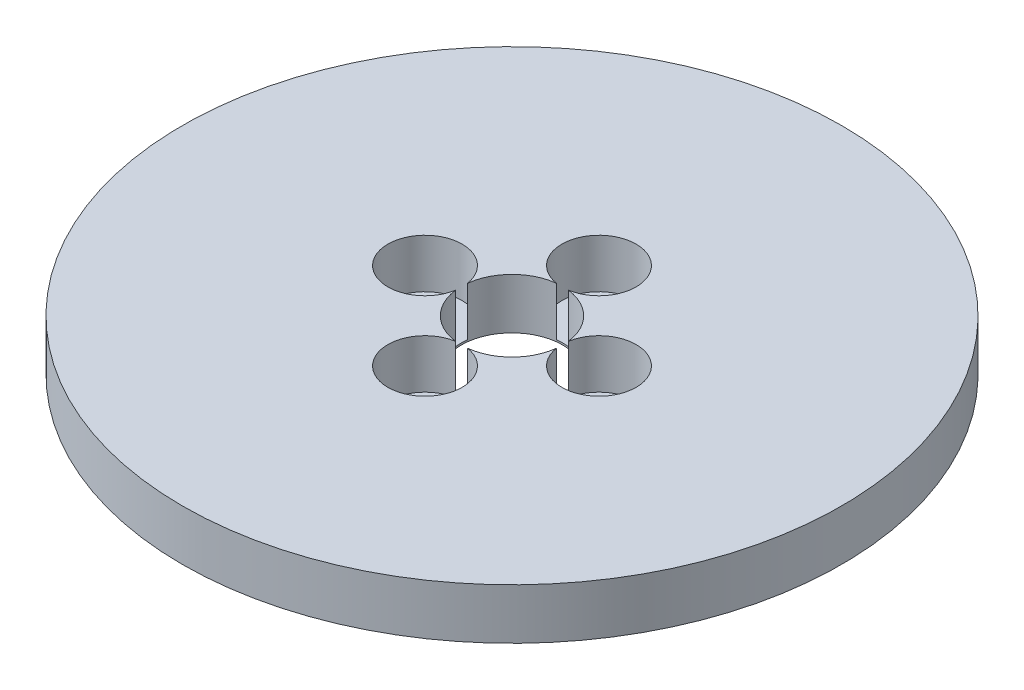
ISO-10303-21;
HEADER;
FILE_DESCRIPTION(('STEP AP214'),'2;1');
FILE_NAME('part.step','',(''),(''),'','','');
FILE_SCHEMA(('AUTOMOTIVE_DESIGN { 1 0 10303 214 1 1 1 1 }'));
ENDSEC;
DATA;
#1=APPLICATION_CONTEXT('core data for automotive mechanical design processes');
#2=APPLICATION_PROTOCOL_DEFINITION('international standard','automotive_design',2000,#1);
#3=PRODUCT_CONTEXT('',#1,'mechanical');
#4=PRODUCT('Part','Part','',(#3));
#5=PRODUCT_RELATED_PRODUCT_CATEGORY('part','',(#4));
#6=PRODUCT_DEFINITION_FORMATION('','',#4);
#7=PRODUCT_DEFINITION_CONTEXT('part definition',#1,'design');
#8=PRODUCT_DEFINITION('design','',#6,#7);
#9=PRODUCT_DEFINITION_SHAPE('','',#8);
#10=(LENGTH_UNIT() NAMED_UNIT(*) SI_UNIT(.MILLI.,.METRE.));
#11=(NAMED_UNIT(*) PLANE_ANGLE_UNIT() SI_UNIT($,.RADIAN.));
#12=(NAMED_UNIT(*) SI_UNIT($,.STERADIAN.) SOLID_ANGLE_UNIT());
#13=UNCERTAINTY_MEASURE_WITH_UNIT(LENGTH_MEASURE(1.E-05),#10,'distance_accuracy_value','');
#14=(GEOMETRIC_REPRESENTATION_CONTEXT(3) GLOBAL_UNCERTAINTY_ASSIGNED_CONTEXT((#13)) GLOBAL_UNIT_ASSIGNED_CONTEXT((#10,
#11,#12)) REPRESENTATION_CONTEXT('',''));
#15=CARTESIAN_POINT('',(0.,0.,0.));
#16=DIRECTION('',(0.,0.,1.));
#17=DIRECTION('',(1.,0.,0.));
#18=AXIS2_PLACEMENT_3D('',#15,#16,#17);
#19=CARTESIAN_POINT('',(0.,10.,0.));
#20=DIRECTION('',(0.,-1.,0.));
#21=DIRECTION('',(0.,0.,-1.));
#22=AXIS2_PLACEMENT_3D('',#19,#20,#21);
#23=CYLINDRICAL_SURFACE('',#22,65.);
#24=CARTESIAN_POINT('',(0.,10.,0.));
#25=DIRECTION('',(0.,1.,0.));
#26=DIRECTION('',(0.,0.,1.));
#27=AXIS2_PLACEMENT_3D('',#24,#25,#26);
#28=CIRCLE('',#27,65.);
#29=CARTESIAN_POINT('',(0.,10.,65.));
#30=VERTEX_POINT('',#29);
#31=EDGE_CURVE('E145',#30,#30,#28,.T.);
#32=ORIENTED_EDGE('',*,*,#31,.F.);
#33=EDGE_LOOP('',(#32));
#34=FACE_BOUND('',#33,.T.);
#35=CARTESIAN_POINT('',(0.,0.,0.));
#36=DIRECTION('',(0.,1.,0.));
#37=DIRECTION('',(0.,0.,1.));
#38=AXIS2_PLACEMENT_3D('',#35,#36,#37);
#39=CIRCLE('',#38,65.);
#40=CARTESIAN_POINT('',(0.,0.,65.));
#41=VERTEX_POINT('',#40);
#42=EDGE_CURVE('E143',#41,#41,#39,.T.);
#43=ORIENTED_EDGE('',*,*,#42,.T.);
#44=EDGE_LOOP('',(#43));
#45=FACE_BOUND('',#44,.T.);
#46=ADVANCED_FACE('F39',(#34,#45),#23,.T.);
#47=CARTESIAN_POINT('',(0.,10.,0.));
#48=DIRECTION('',(0.,1.,0.));
#49=DIRECTION('',(0.,0.,1.));
#50=AXIS2_PLACEMENT_3D('',#47,#48,#49);
#51=PLANE('',#50);
#52=CARTESIAN_POINT('',(0.,10.,17.1570513405143));
#53=DIRECTION('',(0.,1.,0.));
#54=DIRECTION('',(1.,0.,0.));
#55=AXIS2_PLACEMENT_3D('',#52,#53,#54);
#56=CIRCLE('',#55,7.31893526986658);
#57=CARTESIAN_POINT('',(-1.16670718838976,10.,9.93170651683585));
#58=VERTEX_POINT('',#57);
#59=CARTESIAN_POINT('',(1.16670718838983,10.,9.93170651683584));
#60=VERTEX_POINT('',#59);
#61=EDGE_CURVE('E152',#58,#60,#56,.T.);
#62=ORIENTED_EDGE('',*,*,#61,.F.);
#63=CARTESIAN_POINT('',(0.,10.,0.));
#64=DIRECTION('',(0.,1.,0.));
#65=DIRECTION('',(0.,0.,1.));
#66=AXIS2_PLACEMENT_3D('',#63,#64,#65);
#67=CIRCLE('',#66,10.);
#68=CARTESIAN_POINT('',(-9.93170651683584,10.,1.1667071883898));
#69=VERTEX_POINT('',#68);
#70=EDGE_CURVE('E133',#69,#58,#67,.T.);
#71=ORIENTED_EDGE('',*,*,#70,.F.);
#72=CARTESIAN_POINT('',(-17.1570513405143,10.,0.));
#73=DIRECTION('',(0.,1.,0.));
#74=DIRECTION('',(0.,0.,1.));
#75=AXIS2_PLACEMENT_3D('',#72,#73,#74);
#76=CIRCLE('',#75,7.31893526986658);
#77=CARTESIAN_POINT('',(-9.93170651683584,10.,-1.1667071883898));
#78=VERTEX_POINT('',#77);
#79=EDGE_CURVE('E128',#78,#69,#76,.T.);
#80=ORIENTED_EDGE('',*,*,#79,.F.);
#81=CARTESIAN_POINT('',(-1.1667071883899,10.,-9.93170651683583));
#82=VERTEX_POINT('',#81);
#83=EDGE_CURVE('E121',#82,#78,#67,.T.);
#84=ORIENTED_EDGE('',*,*,#83,.F.);
#85=CARTESIAN_POINT('',(-1.79710573754937E-13,10.,-17.1570513405143));
#86=DIRECTION('',(0.,1.,0.));
#87=DIRECTION('',(-1.,0.,0.));
#88=AXIS2_PLACEMENT_3D('',#85,#86,#87);
#89=CIRCLE('',#88,7.31893526986658);
#90=CARTESIAN_POINT('',(1.16670718838969,10.,-9.93170651683586));
#91=VERTEX_POINT('',#90);
#92=EDGE_CURVE('E105',#91,#82,#89,.T.);
#93=ORIENTED_EDGE('',*,*,#92,.F.);
#94=CARTESIAN_POINT('',(9.93170651683584,10.,-1.1667071883898));
#95=VERTEX_POINT('',#94);
#96=EDGE_CURVE('E131',#95,#91,#67,.T.);
#97=ORIENTED_EDGE('',*,*,#96,.F.);
#98=CARTESIAN_POINT('',(17.1570513405143,10.,0.));
#99=DIRECTION('',(0.,1.,0.));
#100=DIRECTION('',(0.,0.,-1.));
#101=AXIS2_PLACEMENT_3D('',#98,#99,#100);
#102=CIRCLE('',#101,7.31893526986658);
#103=CARTESIAN_POINT('',(9.93170651683584,10.,1.1667071883898));
#104=VERTEX_POINT('',#103);
#105=EDGE_CURVE('E154',#104,#95,#102,.T.);
#106=ORIENTED_EDGE('',*,*,#105,.F.);
#107=EDGE_CURVE('E134',#60,#104,#67,.T.);
#108=ORIENTED_EDGE('',*,*,#107,.F.);
#109=EDGE_LOOP('',(#62,#71,#80,#84,#93,#97,#106,#108));
#110=FACE_BOUND('',#109,.T.);
#111=ORIENTED_EDGE('',*,*,#31,.T.);
#112=EDGE_LOOP('',(#111));
#113=FACE_BOUND('',#112,.T.);
#114=ADVANCED_FACE('F130',(#110,#113),#51,.T.);
#115=CARTESIAN_POINT('',(0.,0.,0.));
#116=DIRECTION('',(0.,1.,0.));
#117=DIRECTION('',(0.,0.,1.));
#118=AXIS2_PLACEMENT_3D('',#115,#116,#117);
#119=PLANE('',#118);
#120=CARTESIAN_POINT('',(0.,0.,0.));
#121=DIRECTION('',(0.,1.,0.));
#122=DIRECTION('',(0.,0.,1.));
#123=AXIS2_PLACEMENT_3D('',#120,#121,#122);
#124=CIRCLE('',#123,10.);
#125=CARTESIAN_POINT('',(0.,0.,10.));
#126=VERTEX_POINT('',#125);
#127=EDGE_CURVE('E135',#126,#126,#124,.T.);
#128=ORIENTED_EDGE('',*,*,#127,.T.);
#129=EDGE_LOOP('',(#128));
#130=FACE_BOUND('',#129,.T.);
#131=ORIENTED_EDGE('',*,*,#42,.F.);
#132=EDGE_LOOP('',(#131));
#133=FACE_BOUND('',#132,.T.);
#134=ADVANCED_FACE('F195',(#130,#133),#119,.F.);
#135=CARTESIAN_POINT('',(0.,10.,0.));
#136=DIRECTION('',(0.,-1.,0.));
#137=DIRECTION('',(0.,0.,-1.));
#138=AXIS2_PLACEMENT_3D('',#135,#136,#137);
#139=CYLINDRICAL_SURFACE('',#138,10.);
#140=DIRECTION('',(0.,1.,0.));
#141=VECTOR('',#140,1.);
#142=CARTESIAN_POINT('',(-1.16670718838977,5.17419219116462,9.93170651683585));
#143=LINE('',#142,#141);
#144=CARTESIAN_POINT('',(-1.16670718838976,0.34838438232924,9.93170651683585));
#145=VERTEX_POINT('',#144);
#146=EDGE_CURVE('E11',#145,#58,#143,.T.);
#147=ORIENTED_EDGE('',*,*,#146,.F.);
#148=CARTESIAN_POINT('',(0.,0.34838438232924,0.));
#149=DIRECTION('',(0.,1.,0.));
#150=DIRECTION('',(0.,0.,1.));
#151=AXIS2_PLACEMENT_3D('',#148,#149,#150);
#152=CIRCLE('',#151,10.);
#153=CARTESIAN_POINT('',(1.16670718838983,0.34838438232924,9.93170651683584));
#154=VERTEX_POINT('',#153);
#155=EDGE_CURVE('E169',#145,#154,#152,.T.);
#156=ORIENTED_EDGE('',*,*,#155,.T.);
#157=DIRECTION('',(0.,1.,0.));
#158=VECTOR('',#157,1.);
#159=CARTESIAN_POINT('',(1.16670718838984,5.17419219116462,9.93170651683584));
#160=LINE('',#159,#158);
#161=EDGE_CURVE('E46',#60,#154,#160,.F.);
#162=ORIENTED_EDGE('',*,*,#161,.F.);
#163=ORIENTED_EDGE('',*,*,#107,.T.);
#164=DIRECTION('',(0.,1.,0.));
#165=VECTOR('',#164,1.);
#166=CARTESIAN_POINT('',(9.93170651683584,5.17419219116462,1.1667071883898));
#167=LINE('',#166,#165);
#168=CARTESIAN_POINT('',(9.93170651683584,0.34838438232924,1.1667071883898));
#169=VERTEX_POINT('',#168);
#170=EDGE_CURVE('E151',#169,#104,#167,.T.);
#171=ORIENTED_EDGE('',*,*,#170,.F.);
#172=CARTESIAN_POINT('',(0.,0.34838438232924,0.));
#173=DIRECTION('',(0.,1.,0.));
#174=DIRECTION('',(0.,0.,1.));
#175=AXIS2_PLACEMENT_3D('',#172,#173,#174);
#176=CIRCLE('',#175,10.);
#177=CARTESIAN_POINT('',(9.93170651683584,0.34838438232924,-1.1667071883898));
#178=VERTEX_POINT('',#177);
#179=EDGE_CURVE('E173',#169,#178,#176,.T.);
#180=ORIENTED_EDGE('',*,*,#179,.T.);
#181=DIRECTION('',(0.,1.,0.));
#182=VECTOR('',#181,1.);
#183=CARTESIAN_POINT('',(9.93170651683584,5.17419219116462,-1.1667071883898));
#184=LINE('',#183,#182);
#185=EDGE_CURVE('E168',#95,#178,#184,.F.);
#186=ORIENTED_EDGE('',*,*,#185,.F.);
#187=ORIENTED_EDGE('',*,*,#96,.T.);
#188=DIRECTION('',(0.,1.,0.));
#189=VECTOR('',#188,1.);
#190=CARTESIAN_POINT('',(1.1667071883897,5.17419219116462,-9.93170651683586));
#191=LINE('',#190,#189);
#192=CARTESIAN_POINT('',(1.16670718838969,0.34838438232924,-9.93170651683586));
#193=VERTEX_POINT('',#192);
#194=EDGE_CURVE('E108',#193,#91,#191,.T.);
#195=ORIENTED_EDGE('',*,*,#194,.F.);
#196=CARTESIAN_POINT('',(0.,0.34838438232924,0.));
#197=DIRECTION('',(0.,1.,0.));
#198=DIRECTION('',(0.,0.,1.));
#199=AXIS2_PLACEMENT_3D('',#196,#197,#198);
#200=CIRCLE('',#199,10.);
#201=CARTESIAN_POINT('',(-1.1667071883899,0.34838438232924,-9.93170651683583));
#202=VERTEX_POINT('',#201);
#203=EDGE_CURVE('E122',#193,#202,#200,.T.);
#204=ORIENTED_EDGE('',*,*,#203,.T.);
#205=DIRECTION('',(0.,1.,0.));
#206=VECTOR('',#205,1.);
#207=CARTESIAN_POINT('',(-1.16670718838991,5.17419219116462,-9.93170651683583));
#208=LINE('',#207,#206);
#209=EDGE_CURVE('E106',#82,#202,#208,.F.);
#210=ORIENTED_EDGE('',*,*,#209,.F.);
#211=ORIENTED_EDGE('',*,*,#83,.T.);
#212=DIRECTION('',(0.,1.,0.));
#213=VECTOR('',#212,1.);
#214=CARTESIAN_POINT('',(-9.93170651683584,5.17419219116462,-1.1667071883898));
#215=LINE('',#214,#213);
#216=CARTESIAN_POINT('',(-9.93170651683584,0.34838438232924,-1.1667071883898));
#217=VERTEX_POINT('',#216);
#218=EDGE_CURVE('E177',#217,#78,#215,.T.);
#219=ORIENTED_EDGE('',*,*,#218,.F.);
#220=CARTESIAN_POINT('',(0.,0.34838438232924,0.));
#221=DIRECTION('',(0.,1.,0.));
#222=DIRECTION('',(0.,0.,1.));
#223=AXIS2_PLACEMENT_3D('',#220,#221,#222);
#224=CIRCLE('',#223,10.);
#225=CARTESIAN_POINT('',(-9.93170651683584,0.34838438232924,1.1667071883898));
#226=VERTEX_POINT('',#225);
#227=EDGE_CURVE('E185',#217,#226,#224,.T.);
#228=ORIENTED_EDGE('',*,*,#227,.T.);
#229=DIRECTION('',(0.,1.,0.));
#230=VECTOR('',#229,1.);
#231=CARTESIAN_POINT('',(-9.93170651683584,5.17419219116462,1.1667071883898));
#232=LINE('',#231,#230);
#233=EDGE_CURVE('E179',#69,#226,#232,.F.);
#234=ORIENTED_EDGE('',*,*,#233,.F.);
#235=ORIENTED_EDGE('',*,*,#70,.T.);
#236=EDGE_LOOP('',(#147,#156,#162,#163,#171,#180,#186,#187,#195,#204,#210,#211,#219,#228,#234,#235));
#237=FACE_BOUND('',#236,.T.);
#238=ORIENTED_EDGE('',*,*,#127,.F.);
#239=EDGE_LOOP('',(#238));
#240=FACE_BOUND('',#239,.T.);
#241=ADVANCED_FACE('F117',(#237,#240),#139,.F.);
#242=CARTESIAN_POINT('',(-17.1570513405143,0.34838438232924,0.));
#243=DIRECTION('',(0.,1.,0.));
#244=DIRECTION('',(0.,0.,1.));
#245=AXIS2_PLACEMENT_3D('',#242,#243,#244);
#246=CYLINDRICAL_SURFACE('',#245,7.31893526986658);
#247=ORIENTED_EDGE('',*,*,#218,.T.);
#248=ORIENTED_EDGE('',*,*,#79,.T.);
#249=ORIENTED_EDGE('',*,*,#233,.T.);
#250=CARTESIAN_POINT('',(-17.1570513405143,0.34838438232924,0.));
#251=DIRECTION('',(0.,1.,0.));
#252=DIRECTION('',(0.,0.,1.));
#253=AXIS2_PLACEMENT_3D('',#250,#251,#252);
#254=CIRCLE('',#253,7.31893526986658);
#255=EDGE_CURVE('E140',#217,#226,#254,.T.);
#256=ORIENTED_EDGE('',*,*,#255,.F.);
#257=EDGE_LOOP('',(#247,#248,#249,#256));
#258=FACE_BOUND('',#257,.T.);
#259=ADVANCED_FACE('F200',(#258),#246,.F.);
#260=CARTESIAN_POINT('',(-17.1570513405143,0.34838438232924,0.));
#261=DIRECTION('',(0.,1.,0.));
#262=DIRECTION('',(0.,0.,1.));
#263=AXIS2_PLACEMENT_3D('',#260,#261,#262);
#264=PLANE('',#263);
#265=ORIENTED_EDGE('',*,*,#255,.T.);
#266=ORIENTED_EDGE('',*,*,#227,.F.);
#267=EDGE_LOOP('',(#265,#266));
#268=FACE_BOUND('',#267,.T.);
#269=ADVANCED_FACE('F202',(#268),#264,.T.);
#270=CARTESIAN_POINT('',(-1.79710573754937E-13,0.34838438232924,-17.1570513405143));
#271=DIRECTION('',(0.,1.,0.));
#272=DIRECTION('',(0.,0.,1.));
#273=AXIS2_PLACEMENT_3D('',#270,#271,#272);
#274=CYLINDRICAL_SURFACE('',#273,7.31893526986658);
#275=ORIENTED_EDGE('',*,*,#194,.T.);
#276=ORIENTED_EDGE('',*,*,#92,.T.);
#277=ORIENTED_EDGE('',*,*,#209,.T.);
#278=CARTESIAN_POINT('',(-1.79710573754937E-13,0.34838438232924,-17.1570513405143));
#279=DIRECTION('',(0.,1.,0.));
#280=DIRECTION('',(-1.,0.,0.));
#281=AXIS2_PLACEMENT_3D('',#278,#279,#280);
#282=CIRCLE('',#281,7.31893526986658);
#283=EDGE_CURVE('E111',#193,#202,#282,.T.);
#284=ORIENTED_EDGE('',*,*,#283,.F.);
#285=EDGE_LOOP('',(#275,#276,#277,#284));
#286=FACE_BOUND('',#285,.T.);
#287=ADVANCED_FACE('F102',(#286),#274,.F.);
#288=CARTESIAN_POINT('',(-1.79710573754937E-13,0.34838438232924,-17.1570513405143));
#289=DIRECTION('',(0.,1.,0.));
#290=DIRECTION('',(-1.,0.,0.));
#291=AXIS2_PLACEMENT_3D('',#288,#289,#290);
#292=PLANE('',#291);
#293=ORIENTED_EDGE('',*,*,#283,.T.);
#294=ORIENTED_EDGE('',*,*,#203,.F.);
#295=EDGE_LOOP('',(#293,#294));
#296=FACE_BOUND('',#295,.T.);
#297=ADVANCED_FACE('F211',(#296),#292,.T.);
#298=CARTESIAN_POINT('',(17.1570513405143,0.34838438232924,0.));
#299=DIRECTION('',(0.,1.,0.));
#300=DIRECTION('',(0.,0.,1.));
#301=AXIS2_PLACEMENT_3D('',#298,#299,#300);
#302=CYLINDRICAL_SURFACE('',#301,7.31893526986658);
#303=ORIENTED_EDGE('',*,*,#170,.T.);
#304=ORIENTED_EDGE('',*,*,#105,.T.);
#305=ORIENTED_EDGE('',*,*,#185,.T.);
#306=CARTESIAN_POINT('',(17.1570513405143,0.34838438232924,0.));
#307=DIRECTION('',(0.,1.,0.));
#308=DIRECTION('',(0.,0.,-1.));
#309=AXIS2_PLACEMENT_3D('',#306,#307,#308);
#310=CIRCLE('',#309,7.31893526986658);
#311=EDGE_CURVE('E56',#169,#178,#310,.T.);
#312=ORIENTED_EDGE('',*,*,#311,.F.);
#313=EDGE_LOOP('',(#303,#304,#305,#312));
#314=FACE_BOUND('',#313,.T.);
#315=ADVANCED_FACE('F212',(#314),#302,.F.);
#316=CARTESIAN_POINT('',(17.1570513405143,0.34838438232924,0.));
#317=DIRECTION('',(0.,1.,0.));
#318=DIRECTION('',(0.,0.,-1.));
#319=AXIS2_PLACEMENT_3D('',#316,#317,#318);
#320=PLANE('',#319);
#321=ORIENTED_EDGE('',*,*,#311,.T.);
#322=ORIENTED_EDGE('',*,*,#179,.F.);
#323=EDGE_LOOP('',(#321,#322));
#324=FACE_BOUND('',#323,.T.);
#325=ADVANCED_FACE('F217',(#324),#320,.T.);
#326=CARTESIAN_POINT('',(0.,0.34838438232924,17.1570513405143));
#327=DIRECTION('',(0.,1.,0.));
#328=DIRECTION('',(0.,0.,1.));
#329=AXIS2_PLACEMENT_3D('',#326,#327,#328);
#330=CYLINDRICAL_SURFACE('',#329,7.31893526986658);
#331=ORIENTED_EDGE('',*,*,#146,.T.);
#332=ORIENTED_EDGE('',*,*,#61,.T.);
#333=ORIENTED_EDGE('',*,*,#161,.T.);
#334=CARTESIAN_POINT('',(0.,0.34838438232924,17.1570513405143));
#335=DIRECTION('',(0.,1.,0.));
#336=DIRECTION('',(1.,0.,0.));
#337=AXIS2_PLACEMENT_3D('',#334,#335,#336);
#338=CIRCLE('',#337,7.31893526986658);
#339=EDGE_CURVE('E55',#145,#154,#338,.T.);
#340=ORIENTED_EDGE('',*,*,#339,.F.);
#341=EDGE_LOOP('',(#331,#332,#333,#340));
#342=FACE_BOUND('',#341,.T.);
#343=ADVANCED_FACE('F170',(#342),#330,.F.);
#344=CARTESIAN_POINT('',(0.,0.34838438232924,17.1570513405143));
#345=DIRECTION('',(0.,1.,0.));
#346=DIRECTION('',(1.,0.,0.));
#347=AXIS2_PLACEMENT_3D('',#344,#345,#346);
#348=PLANE('',#347);
#349=ORIENTED_EDGE('',*,*,#339,.T.);
#350=ORIENTED_EDGE('',*,*,#155,.F.);
#351=EDGE_LOOP('',(#349,#350));
#352=FACE_BOUND('',#351,.T.);
#353=ADVANCED_FACE('F224',(#352),#348,.T.);
#354=CLOSED_SHELL('',(#46,#114,#134,#241,#259,#269,#287,#297,#315,#325,#343,#353));
#355=MANIFOLD_SOLID_BREP('B2',#354);
#356=ADVANCED_BREP_SHAPE_REPRESENTATION('',(#18,#355),#14);
#357=SHAPE_DEFINITION_REPRESENTATION(#9,#356);
ENDSEC;
END-ISO-10303-21;
